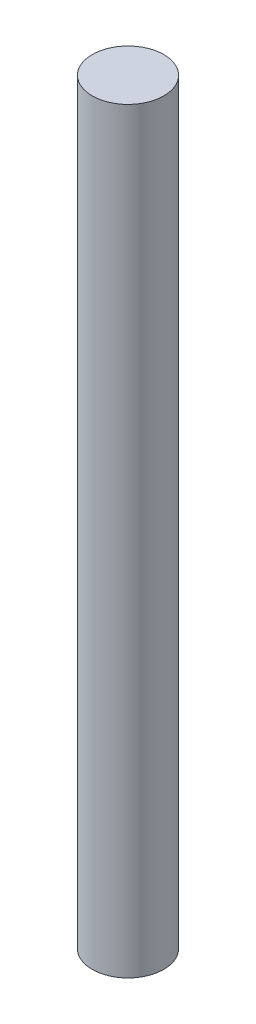
ISO-10303-21;
HEADER;
FILE_DESCRIPTION(('STEP AP214'),'2;1');
FILE_NAME('part.step','',(''),(''),'','','');
FILE_SCHEMA(('AUTOMOTIVE_DESIGN { 1 0 10303 214 1 1 1 1 }'));
ENDSEC;
DATA;
#1=APPLICATION_CONTEXT('core data for automotive mechanical design processes');
#2=APPLICATION_PROTOCOL_DEFINITION('international standard','automotive_design',2000,#1);
#3=PRODUCT_CONTEXT('',#1,'mechanical');
#4=PRODUCT('Part','Part','',(#3));
#5=PRODUCT_RELATED_PRODUCT_CATEGORY('part','',(#4));
#6=PRODUCT_DEFINITION_FORMATION('','',#4);
#7=PRODUCT_DEFINITION_CONTEXT('part definition',#1,'design');
#8=PRODUCT_DEFINITION('design','',#6,#7);
#9=PRODUCT_DEFINITION_SHAPE('','',#8);
#10=(LENGTH_UNIT() NAMED_UNIT(*) SI_UNIT(.MILLI.,.METRE.));
#11=(NAMED_UNIT(*) PLANE_ANGLE_UNIT() SI_UNIT($,.RADIAN.));
#12=(NAMED_UNIT(*) SI_UNIT($,.STERADIAN.) SOLID_ANGLE_UNIT());
#13=UNCERTAINTY_MEASURE_WITH_UNIT(LENGTH_MEASURE(1.E-05),#10,'distance_accuracy_value','');
#14=(GEOMETRIC_REPRESENTATION_CONTEXT(3) GLOBAL_UNCERTAINTY_ASSIGNED_CONTEXT((#13)) GLOBAL_UNIT_ASSIGNED_CONTEXT((#10,
#11,#12)) REPRESENTATION_CONTEXT('',''));
#15=CARTESIAN_POINT('',(0.,0.,0.));
#16=DIRECTION('',(0.,0.,1.));
#17=DIRECTION('',(1.,0.,0.));
#18=AXIS2_PLACEMENT_3D('',#15,#16,#17);
#19=CARTESIAN_POINT('',(0.,0.64,0.));
#20=DIRECTION('',(0.,1.,0.));
#21=DIRECTION('',(0.,0.,1.));
#22=AXIS2_PLACEMENT_3D('',#19,#20,#21);
#23=PLANE('',#22);
#24=CARTESIAN_POINT('',(0.,0.64,2.87));
#25=DIRECTION('',(0.,-1.,0.));
#26=DIRECTION('',(0.,0.,-1.));
#27=AXIS2_PLACEMENT_3D('',#24,#25,#26);
#28=CIRCLE('',#27,0.255);
#29=CARTESIAN_POINT('',(0.,0.64,2.615));
#30=VERTEX_POINT('',#29);
#31=EDGE_CURVE('E18',#30,#30,#28,.T.);
#32=ORIENTED_EDGE('',*,*,#31,.F.);
#33=EDGE_LOOP('',(#32));
#34=FACE_BOUND('',#33,.T.);
#35=ADVANCED_FACE('F15',(#34),#23,.T.);
#36=CARTESIAN_POINT('',(0.,-4.75,2.87));
#37=DIRECTION('',(0.,1.,0.));
#38=DIRECTION('',(0.,0.,1.));
#39=AXIS2_PLACEMENT_3D('',#36,#37,#38);
#40=PLANE('',#39);
#41=CARTESIAN_POINT('',(0.,-4.75,2.87));
#42=DIRECTION('',(0.,-1.,0.));
#43=DIRECTION('',(0.,0.,-1.));
#44=AXIS2_PLACEMENT_3D('',#41,#42,#43);
#45=CIRCLE('',#44,0.255);
#46=CARTESIAN_POINT('',(0.,-4.75,2.615));
#47=VERTEX_POINT('',#46);
#48=EDGE_CURVE('E10',#47,#47,#45,.F.);
#49=ORIENTED_EDGE('',*,*,#48,.F.);
#50=EDGE_LOOP('',(#49));
#51=FACE_BOUND('',#50,.T.);
#52=ADVANCED_FACE('F30',(#51),#40,.F.);
#53=CARTESIAN_POINT('',(0.,1.36124891681,2.87));
#54=DIRECTION('',(0.,-1.,0.));
#55=DIRECTION('',(0.,0.,-1.));
#56=AXIS2_PLACEMENT_3D('',#53,#54,#55);
#57=CYLINDRICAL_SURFACE('',#56,0.255);
#58=ORIENTED_EDGE('',*,*,#48,.T.);
#59=EDGE_LOOP('',(#58));
#60=FACE_BOUND('',#59,.T.);
#61=ORIENTED_EDGE('',*,*,#31,.T.);
#62=EDGE_LOOP('',(#61));
#63=FACE_BOUND('',#62,.T.);
#64=ADVANCED_FACE('F27',(#60,#63),#57,.T.);
#65=CLOSED_SHELL('',(#35,#52,#64));
#66=MANIFOLD_SOLID_BREP('B1',#65);
#67=ADVANCED_BREP_SHAPE_REPRESENTATION('',(#18,#66),#14);
#68=SHAPE_DEFINITION_REPRESENTATION(#9,#67);
ENDSEC;
END-ISO-10303-21;
